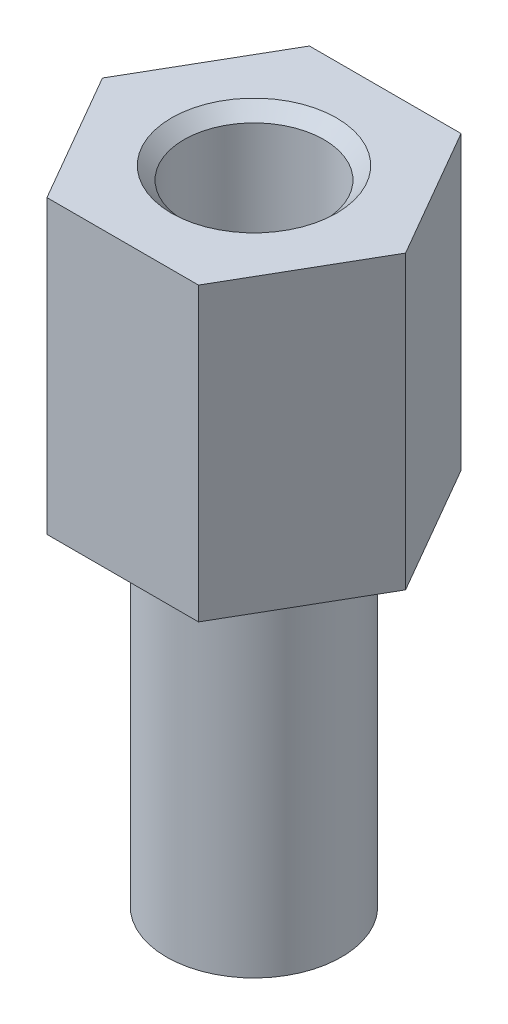
ISO-10303-21;
HEADER;
FILE_DESCRIPTION(('STEP AP214'),'2;1');
FILE_NAME('part.step','',(''),(''),'','','');
FILE_SCHEMA(('AUTOMOTIVE_DESIGN { 1 0 10303 214 1 1 1 1 }'));
ENDSEC;
DATA;
#1=APPLICATION_CONTEXT('core data for automotive mechanical design processes');
#2=APPLICATION_PROTOCOL_DEFINITION('international standard','automotive_design',2000,#1);
#3=PRODUCT_CONTEXT('',#1,'mechanical');
#4=PRODUCT('Part','Part','',(#3));
#5=PRODUCT_RELATED_PRODUCT_CATEGORY('part','',(#4));
#6=PRODUCT_DEFINITION_FORMATION('','',#4);
#7=PRODUCT_DEFINITION_CONTEXT('part definition',#1,'design');
#8=PRODUCT_DEFINITION('design','',#6,#7);
#9=PRODUCT_DEFINITION_SHAPE('','',#8);
#10=(LENGTH_UNIT() NAMED_UNIT(*) SI_UNIT(.MILLI.,.METRE.));
#11=(NAMED_UNIT(*) PLANE_ANGLE_UNIT() SI_UNIT($,.RADIAN.));
#12=(NAMED_UNIT(*) SI_UNIT($,.STERADIAN.) SOLID_ANGLE_UNIT());
#13=UNCERTAINTY_MEASURE_WITH_UNIT(LENGTH_MEASURE(1.E-05),#10,'distance_accuracy_value','');
#14=(GEOMETRIC_REPRESENTATION_CONTEXT(3) GLOBAL_UNCERTAINTY_ASSIGNED_CONTEXT((#13)) GLOBAL_UNIT_ASSIGNED_CONTEXT((#10,
#11,#12)) REPRESENTATION_CONTEXT('',''));
#15=CARTESIAN_POINT('',(0.,0.,0.));
#16=DIRECTION('',(0.,0.,1.));
#17=DIRECTION('',(1.,0.,0.));
#18=AXIS2_PLACEMENT_3D('',#15,#16,#17);
#19=CARTESIAN_POINT('',(0.,0.,0.));
#20=DIRECTION('',(0.,-1.,0.));
#21=DIRECTION('',(0.,0.,-1.));
#22=AXIS2_PLACEMENT_3D('',#19,#20,#21);
#23=PLANE('',#22);
#24=CARTESIAN_POINT('',(0.,0.,0.));
#25=DIRECTION('',(0.,-1.,0.));
#26=DIRECTION('',(0.,0.,-1.));
#27=AXIS2_PLACEMENT_3D('',#24,#25,#26);
#28=CIRCLE('',#27,1.2);
#29=CARTESIAN_POINT('',(0.,0.,-1.2));
#30=VERTEX_POINT('',#29);
#31=EDGE_CURVE('E20',#30,#30,#28,.F.);
#32=ORIENTED_EDGE('',*,*,#31,.T.);
#33=EDGE_LOOP('',(#32));
#34=FACE_BOUND('',#33,.T.);
#35=ADVANCED_FACE('F17',(#34),#23,.F.);
#36=CARTESIAN_POINT('',(0.,4.,0.));
#37=DIRECTION('',(0.,-1.,0.));
#38=DIRECTION('',(0.,0.,-1.));
#39=AXIS2_PLACEMENT_3D('',#36,#37,#38);
#40=CYLINDRICAL_SURFACE('',#39,1.2);
#41=CARTESIAN_POINT('',(0.,3.78499999999349,0.));
#42=DIRECTION('',(0.,1.,0.));
#43=DIRECTION('',(0.,0.,1.));
#44=AXIS2_PLACEMENT_3D('',#41,#42,#43);
#45=CIRCLE('',#44,1.19999999992615);
#46=CARTESIAN_POINT('',(0.,3.78499999999349,1.19999999992615));
#47=VERTEX_POINT('',#46);
#48=EDGE_CURVE('E98',#47,#47,#45,.T.);
#49=ORIENTED_EDGE('',*,*,#48,.T.);
#50=EDGE_LOOP('',(#49));
#51=FACE_BOUND('',#50,.T.);
#52=ORIENTED_EDGE('',*,*,#31,.F.);
#53=EDGE_LOOP('',(#52));
#54=FACE_BOUND('',#53,.T.);
#55=ADVANCED_FACE('F108',(#51,#54),#40,.F.);
#56=CARTESIAN_POINT('',(0.,4.00000000007594,0.));
#57=DIRECTION('',(0.,1.,0.));
#58=DIRECTION('',(0.,0.,1.));
#59=AXIS2_PLACEMENT_3D('',#56,#57,#58);
#60=CONICAL_SURFACE('',#59,1.4150000000086,0.785398163397448);
#61=ORIENTED_EDGE('',*,*,#48,.F.);
#62=EDGE_LOOP('',(#61));
#63=FACE_BOUND('',#62,.T.);
#64=CARTESIAN_POINT('',(0.,4.0000000000191,0.));
#65=DIRECTION('',(0.,1.,0.));
#66=DIRECTION('',(0.,0.,1.));
#67=AXIS2_PLACEMENT_3D('',#64,#65,#66);
#68=CIRCLE('',#67,1.41499999995176);
#69=CARTESIAN_POINT('',(0.,4.0000000000191,1.41499999995176));
#70=VERTEX_POINT('',#69);
#71=EDGE_CURVE('E87',#70,#70,#68,.F.);
#72=ORIENTED_EDGE('',*,*,#71,.F.);
#73=EDGE_LOOP('',(#72));
#74=FACE_BOUND('',#73,.T.);
#75=ADVANCED_FACE('F106',(#63,#74),#60,.F.);
#76=CARTESIAN_POINT('',(0.,4.,0.));
#77=DIRECTION('',(0.,1.,0.));
#78=DIRECTION('',(0.,0.,1.));
#79=AXIS2_PLACEMENT_3D('',#76,#77,#78);
#80=PLANE('',#79);
#81=DIRECTION('',(-0.5,0.,-0.866025403784439));
#82=VECTOR('',#81,1.);
#83=CARTESIAN_POINT('',(-2.59807621135332,4.,0.));
#84=LINE('',#83,#82);
#85=CARTESIAN_POINT('',(-2.59807621135332,4.,0.));
#86=VERTEX_POINT('',#85);
#87=CARTESIAN_POINT('',(-1.29903810567666,4.,2.25));
#88=VERTEX_POINT('',#87);
#89=EDGE_CURVE('E265',#86,#88,#84,.F.);
#90=ORIENTED_EDGE('',*,*,#89,.T.);
#91=DIRECTION('',(-1.,0.,0.));
#92=VECTOR('',#91,1.);
#93=CARTESIAN_POINT('',(-1.29903810567666,4.,2.25));
#94=LINE('',#93,#92);
#95=CARTESIAN_POINT('',(1.29903810567666,4.,2.25));
#96=VERTEX_POINT('',#95);
#97=EDGE_CURVE('E68',#88,#96,#94,.F.);
#98=ORIENTED_EDGE('',*,*,#97,.T.);
#99=DIRECTION('',(-0.5,0.,0.866025403784439));
#100=VECTOR('',#99,1.);
#101=CARTESIAN_POINT('',(1.29903810567666,4.,2.25));
#102=LINE('',#101,#100);
#103=CARTESIAN_POINT('',(2.59807621135332,4.,0.));
#104=VERTEX_POINT('',#103);
#105=EDGE_CURVE('E70',#96,#104,#102,.F.);
#106=ORIENTED_EDGE('',*,*,#105,.T.);
#107=DIRECTION('',(0.5,0.,0.866025403784439));
#108=VECTOR('',#107,1.);
#109=CARTESIAN_POINT('',(2.59807621135332,4.,0.));
#110=LINE('',#109,#108);
#111=CARTESIAN_POINT('',(1.29903810567666,4.,-2.25));
#112=VERTEX_POINT('',#111);
#113=EDGE_CURVE('E74',#104,#112,#110,.F.);
#114=ORIENTED_EDGE('',*,*,#113,.T.);
#115=DIRECTION('',(1.,0.,0.));
#116=VECTOR('',#115,1.);
#117=CARTESIAN_POINT('',(1.29903810567666,4.,-2.25));
#118=LINE('',#117,#116);
#119=CARTESIAN_POINT('',(-1.29903810567666,4.,-2.25));
#120=VERTEX_POINT('',#119);
#121=EDGE_CURVE('E258',#112,#120,#118,.F.);
#122=ORIENTED_EDGE('',*,*,#121,.T.);
#123=DIRECTION('',(0.5,0.,-0.866025403784439));
#124=VECTOR('',#123,1.);
#125=CARTESIAN_POINT('',(-1.29903810567666,4.,-2.25));
#126=LINE('',#125,#124);
#127=EDGE_CURVE('E262',#120,#86,#126,.F.);
#128=ORIENTED_EDGE('',*,*,#127,.T.);
#129=EDGE_LOOP('',(#90,#98,#106,#114,#122,#128));
#130=FACE_BOUND('',#129,.T.);
#131=ORIENTED_EDGE('',*,*,#71,.T.);
#132=EDGE_LOOP('',(#131));
#133=FACE_BOUND('',#132,.T.);
#134=ADVANCED_FACE('F72',(#130,#133),#80,.T.);
#135=CARTESIAN_POINT('',(2.59807621135332,4.,0.));
#136=DIRECTION('',(-0.866025403784439,0.,0.5));
#137=DIRECTION('',(0.5,0.,0.866025403784439));
#138=AXIS2_PLACEMENT_3D('',#135,#136,#137);
#139=PLANE('',#138);
#140=DIRECTION('',(0.5,0.,0.866025403784439));
#141=VECTOR('',#140,1.);
#142=CARTESIAN_POINT('',(1.29903810567666,-1.,-2.25));
#143=LINE('',#142,#141);
#144=CARTESIAN_POINT('',(1.29903810567666,-1.,-2.25));
#145=VERTEX_POINT('',#144);
#146=CARTESIAN_POINT('',(2.59807621135332,-1.,0.));
#147=VERTEX_POINT('',#146);
#148=EDGE_CURVE('E251',#145,#147,#143,.T.);
#149=ORIENTED_EDGE('',*,*,#148,.F.);
#150=DIRECTION('',(0.,1.,0.));
#151=VECTOR('',#150,1.);
#152=CARTESIAN_POINT('',(1.29903810567666,4.,-2.25));
#153=LINE('',#152,#151);
#154=EDGE_CURVE('E85',#145,#112,#153,.T.);
#155=ORIENTED_EDGE('',*,*,#154,.T.);
#156=ORIENTED_EDGE('',*,*,#113,.F.);
#157=DIRECTION('',(0.,1.,0.));
#158=VECTOR('',#157,1.);
#159=CARTESIAN_POINT('',(2.59807621135332,4.,0.));
#160=LINE('',#159,#158);
#161=EDGE_CURVE('E79',#104,#147,#160,.F.);
#162=ORIENTED_EDGE('',*,*,#161,.T.);
#163=EDGE_LOOP('',(#149,#155,#156,#162));
#164=FACE_BOUND('',#163,.T.);
#165=ADVANCED_FACE('F82',(#164),#139,.F.);
#166=CARTESIAN_POINT('',(1.29903810567666,4.,2.25));
#167=DIRECTION('',(-0.866025403784439,0.,-0.5));
#168=DIRECTION('',(-0.5,0.,0.866025403784439));
#169=AXIS2_PLACEMENT_3D('',#166,#167,#168);
#170=PLANE('',#169);
#171=DIRECTION('',(-0.5,0.,0.866025403784439));
#172=VECTOR('',#171,1.);
#173=CARTESIAN_POINT('',(2.59807621135332,-1.,0.));
#174=LINE('',#173,#172);
#175=CARTESIAN_POINT('',(1.29903810567666,-1.,2.25));
#176=VERTEX_POINT('',#175);
#177=EDGE_CURVE('E91',#147,#176,#174,.T.);
#178=ORIENTED_EDGE('',*,*,#177,.F.);
#179=ORIENTED_EDGE('',*,*,#161,.F.);
#180=ORIENTED_EDGE('',*,*,#105,.F.);
#181=DIRECTION('',(0.,1.,0.));
#182=VECTOR('',#181,1.);
#183=CARTESIAN_POINT('',(1.29903810567666,4.,2.25));
#184=LINE('',#183,#182);
#185=EDGE_CURVE('E94',#96,#176,#184,.F.);
#186=ORIENTED_EDGE('',*,*,#185,.T.);
#187=EDGE_LOOP('',(#178,#179,#180,#186));
#188=FACE_BOUND('',#187,.T.);
#189=ADVANCED_FACE('F89',(#188),#170,.F.);
#190=CARTESIAN_POINT('',(-1.29903810567666,4.,2.25));
#191=DIRECTION('',(0.,0.,-1.));
#192=DIRECTION('',(-1.,0.,0.));
#193=AXIS2_PLACEMENT_3D('',#190,#191,#192);
#194=PLANE('',#193);
#195=DIRECTION('',(1.,0.,0.));
#196=VECTOR('',#195,1.);
#197=CARTESIAN_POINT('',(0.,-1.,2.25));
#198=LINE('',#197,#196);
#199=CARTESIAN_POINT('',(-1.29903810567666,-1.,2.25));
#200=VERTEX_POINT('',#199);
#201=EDGE_CURVE('E241',#176,#200,#198,.F.);
#202=ORIENTED_EDGE('',*,*,#201,.F.);
#203=ORIENTED_EDGE('',*,*,#185,.F.);
#204=ORIENTED_EDGE('',*,*,#97,.F.);
#205=DIRECTION('',(0.,1.,0.));
#206=VECTOR('',#205,1.);
#207=CARTESIAN_POINT('',(-1.29903810567666,4.,2.25));
#208=LINE('',#207,#206);
#209=EDGE_CURVE('E243',#88,#200,#208,.F.);
#210=ORIENTED_EDGE('',*,*,#209,.T.);
#211=EDGE_LOOP('',(#202,#203,#204,#210));
#212=FACE_BOUND('',#211,.T.);
#213=ADVANCED_FACE('F145',(#212),#194,.F.);
#214=CARTESIAN_POINT('',(-2.59807621135332,4.,0.));
#215=DIRECTION('',(0.866025403784439,0.,-0.5));
#216=DIRECTION('',(-0.5,0.,-0.866025403784439));
#217=AXIS2_PLACEMENT_3D('',#214,#215,#216);
#218=PLANE('',#217);
#219=DIRECTION('',(-0.5,0.,-0.866025403784439));
#220=VECTOR('',#219,1.);
#221=CARTESIAN_POINT('',(-1.29903810567666,-1.,2.25));
#222=LINE('',#221,#220);
#223=CARTESIAN_POINT('',(-2.59807621135332,-1.,0.));
#224=VERTEX_POINT('',#223);
#225=EDGE_CURVE('E247',#200,#224,#222,.T.);
#226=ORIENTED_EDGE('',*,*,#225,.F.);
#227=ORIENTED_EDGE('',*,*,#209,.F.);
#228=ORIENTED_EDGE('',*,*,#89,.F.);
#229=DIRECTION('',(0.,1.,0.));
#230=VECTOR('',#229,1.);
#231=CARTESIAN_POINT('',(-2.59807621135332,4.,0.));
#232=LINE('',#231,#230);
#233=EDGE_CURVE('E260',#86,#224,#232,.F.);
#234=ORIENTED_EDGE('',*,*,#233,.T.);
#235=EDGE_LOOP('',(#226,#227,#228,#234));
#236=FACE_BOUND('',#235,.T.);
#237=ADVANCED_FACE('F142',(#236),#218,.F.);
#238=CARTESIAN_POINT('',(-1.29903810567666,4.,-2.25));
#239=DIRECTION('',(0.866025403784439,0.,0.5));
#240=DIRECTION('',(0.5,0.,-0.866025403784439));
#241=AXIS2_PLACEMENT_3D('',#238,#239,#240);
#242=PLANE('',#241);
#243=DIRECTION('',(0.5,0.,-0.866025403784439));
#244=VECTOR('',#243,1.);
#245=CARTESIAN_POINT('',(-2.59807621135332,-1.,0.));
#246=LINE('',#245,#244);
#247=CARTESIAN_POINT('',(-1.29903810567666,-1.,-2.25));
#248=VERTEX_POINT('',#247);
#249=EDGE_CURVE('E268',#224,#248,#246,.T.);
#250=ORIENTED_EDGE('',*,*,#249,.F.);
#251=ORIENTED_EDGE('',*,*,#233,.F.);
#252=ORIENTED_EDGE('',*,*,#127,.F.);
#253=DIRECTION('',(0.,1.,0.));
#254=VECTOR('',#253,1.);
#255=CARTESIAN_POINT('',(-1.29903810567666,4.,-2.25));
#256=LINE('',#255,#254);
#257=EDGE_CURVE('E35',#120,#248,#256,.F.);
#258=ORIENTED_EDGE('',*,*,#257,.T.);
#259=EDGE_LOOP('',(#250,#251,#252,#258));
#260=FACE_BOUND('',#259,.T.);
#261=ADVANCED_FACE('F138',(#260),#242,.F.);
#262=CARTESIAN_POINT('',(1.29903810567666,4.,-2.25));
#263=DIRECTION('',(0.,0.,1.));
#264=DIRECTION('',(1.,0.,0.));
#265=AXIS2_PLACEMENT_3D('',#262,#263,#264);
#266=PLANE('',#265);
#267=DIRECTION('',(1.,0.,0.));
#268=VECTOR('',#267,1.);
#269=CARTESIAN_POINT('',(0.,-1.,-2.25));
#270=LINE('',#269,#268);
#271=EDGE_CURVE('E102',#248,#145,#270,.T.);
#272=ORIENTED_EDGE('',*,*,#271,.F.);
#273=ORIENTED_EDGE('',*,*,#257,.F.);
#274=ORIENTED_EDGE('',*,*,#121,.F.);
#275=ORIENTED_EDGE('',*,*,#154,.F.);
#276=EDGE_LOOP('',(#272,#273,#274,#275));
#277=FACE_BOUND('',#276,.T.);
#278=ADVANCED_FACE('F134',(#277),#266,.F.);
#279=CARTESIAN_POINT('',(0.,-7.,0.));
#280=DIRECTION('',(0.,-1.,0.));
#281=DIRECTION('',(0.,0.,-1.));
#282=AXIS2_PLACEMENT_3D('',#279,#280,#281);
#283=PLANE('',#282);
#284=CARTESIAN_POINT('',(0.,-7.,0.));
#285=DIRECTION('',(0.,1.,0.));
#286=DIRECTION('',(0.,0.,1.));
#287=AXIS2_PLACEMENT_3D('',#284,#285,#286);
#288=CIRCLE('',#287,1.5);
#289=CARTESIAN_POINT('',(0.,-7.,1.5));
#290=VERTEX_POINT('',#289);
#291=EDGE_CURVE('E26',#290,#290,#288,.T.);
#292=ORIENTED_EDGE('',*,*,#291,.F.);
#293=EDGE_LOOP('',(#292));
#294=FACE_BOUND('',#293,.T.);
#295=ADVANCED_FACE('F127',(#294),#283,.T.);
#296=CARTESIAN_POINT('',(0.,-1.,0.));
#297=DIRECTION('',(0.,-1.,0.));
#298=DIRECTION('',(0.,0.,-1.));
#299=AXIS2_PLACEMENT_3D('',#296,#297,#298);
#300=PLANE('',#299);
#301=CARTESIAN_POINT('',(0.,-1.,0.));
#302=DIRECTION('',(0.,1.,0.));
#303=DIRECTION('',(0.,0.,1.));
#304=AXIS2_PLACEMENT_3D('',#301,#302,#303);
#305=CIRCLE('',#304,1.5);
#306=CARTESIAN_POINT('',(0.,-1.,1.5));
#307=VERTEX_POINT('',#306);
#308=EDGE_CURVE('E11',#307,#307,#305,.F.);
#309=ORIENTED_EDGE('',*,*,#308,.F.);
#310=EDGE_LOOP('',(#309));
#311=FACE_BOUND('',#310,.T.);
#312=ORIENTED_EDGE('',*,*,#249,.T.);
#313=ORIENTED_EDGE('',*,*,#271,.T.);
#314=ORIENTED_EDGE('',*,*,#148,.T.);
#315=ORIENTED_EDGE('',*,*,#177,.T.);
#316=ORIENTED_EDGE('',*,*,#201,.T.);
#317=ORIENTED_EDGE('',*,*,#225,.T.);
#318=EDGE_LOOP('',(#312,#313,#314,#315,#316,#317));
#319=FACE_BOUND('',#318,.T.);
#320=ADVANCED_FACE('F121',(#311,#319),#300,.T.);
#321=CARTESIAN_POINT('',(0.,-7.,0.));
#322=DIRECTION('',(0.,1.,0.));
#323=DIRECTION('',(0.,0.,1.));
#324=AXIS2_PLACEMENT_3D('',#321,#322,#323);
#325=CYLINDRICAL_SURFACE('',#324,1.5);
#326=ORIENTED_EDGE('',*,*,#308,.T.);
#327=EDGE_LOOP('',(#326));
#328=FACE_BOUND('',#327,.T.);
#329=ORIENTED_EDGE('',*,*,#291,.T.);
#330=EDGE_LOOP('',(#329));
#331=FACE_BOUND('',#330,.T.);
#332=ADVANCED_FACE('F119',(#328,#331),#325,.T.);
#333=CLOSED_SHELL('',(#35,#55,#75,#134,#165,#189,#213,#237,#261,#278,#295,#320,#332));
#334=MANIFOLD_SOLID_BREP('B1',#333);
#335=ADVANCED_BREP_SHAPE_REPRESENTATION('',(#18,#334),#14);
#336=SHAPE_DEFINITION_REPRESENTATION(#9,#335);
ENDSEC;
END-ISO-10303-21;
